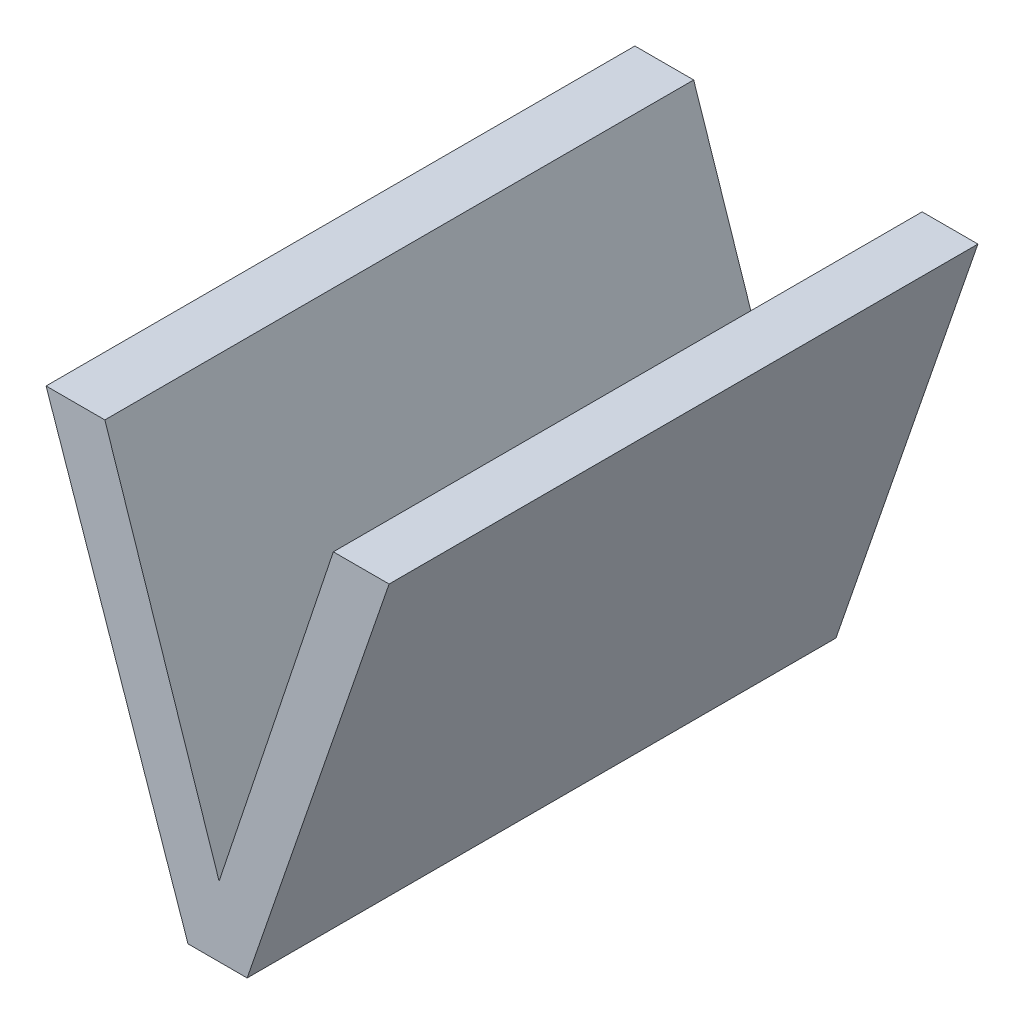
ISO-10303-21;
HEADER;
FILE_DESCRIPTION(('STEP AP214'),'2;1');
FILE_NAME('part.step','',(''),(''),'','','');
FILE_SCHEMA(('AUTOMOTIVE_DESIGN { 1 0 10303 214 1 1 1 1 }'));
ENDSEC;
DATA;
#1=APPLICATION_CONTEXT('core data for automotive mechanical design processes');
#2=APPLICATION_PROTOCOL_DEFINITION('international standard','automotive_design',2000,#1);
#3=PRODUCT_CONTEXT('',#1,'mechanical');
#4=PRODUCT('Part','Part','',(#3));
#5=PRODUCT_RELATED_PRODUCT_CATEGORY('part','',(#4));
#6=PRODUCT_DEFINITION_FORMATION('','',#4);
#7=PRODUCT_DEFINITION_CONTEXT('part definition',#1,'design');
#8=PRODUCT_DEFINITION('design','',#6,#7);
#9=PRODUCT_DEFINITION_SHAPE('','',#8);
#10=(LENGTH_UNIT() NAMED_UNIT(*) SI_UNIT(.MILLI.,.METRE.));
#11=(NAMED_UNIT(*) PLANE_ANGLE_UNIT() SI_UNIT($,.RADIAN.));
#12=(NAMED_UNIT(*) SI_UNIT($,.STERADIAN.) SOLID_ANGLE_UNIT());
#13=UNCERTAINTY_MEASURE_WITH_UNIT(LENGTH_MEASURE(1.E-05),#10,'distance_accuracy_value','');
#14=(GEOMETRIC_REPRESENTATION_CONTEXT(3) GLOBAL_UNCERTAINTY_ASSIGNED_CONTEXT((#13)) GLOBAL_UNIT_ASSIGNED_CONTEXT((#10,
#11,#12)) REPRESENTATION_CONTEXT('',''));
#15=CARTESIAN_POINT('',(0.,0.,0.));
#16=DIRECTION('',(0.,0.,1.));
#17=DIRECTION('',(1.,0.,0.));
#18=AXIS2_PLACEMENT_3D('',#15,#16,#17);
#19=CARTESIAN_POINT('',(0.958975384141096,-0.571914597659679,0.));
#20=DIRECTION('',(0.,-1.,0.));
#21=DIRECTION('',(1.,0.,0.));
#22=AXIS2_PLACEMENT_3D('',#19,#20,#21);
#23=PLANE('',#22);
#24=DIRECTION('',(-1.,0.,0.));
#25=VECTOR('',#24,1.);
#26=CARTESIAN_POINT('',(0.969015903089588,-0.571914597659679,0.));
#27=LINE('',#26,#25);
#28=CARTESIAN_POINT('',(0.969015903089588,-0.571914597659679,0.));
#29=VERTEX_POINT('',#28);
#30=CARTESIAN_POINT('',(0.958975384141096,-0.571914597659679,0.));
#31=VERTEX_POINT('',#30);
#32=EDGE_CURVE('E11',#29,#31,#27,.T.);
#33=ORIENTED_EDGE('',*,*,#32,.F.);
#34=DIRECTION('',(0.,0.,1.));
#35=VECTOR('',#34,1.);
#36=CARTESIAN_POINT('',(0.969015903089588,-0.571914597659679,0.));
#37=LINE('',#36,#35);
#38=CARTESIAN_POINT('',(0.969015903089588,-0.571914597659679,0.1));
#39=VERTEX_POINT('',#38);
#40=EDGE_CURVE('E131',#29,#39,#37,.T.);
#41=ORIENTED_EDGE('',*,*,#40,.T.);
#42=DIRECTION('',(1.,0.,0.));
#43=VECTOR('',#42,1.);
#44=CARTESIAN_POINT('',(0.958975384141096,-0.571914597659679,0.1));
#45=LINE('',#44,#43);
#46=CARTESIAN_POINT('',(0.958975384141096,-0.571914597659679,0.1));
#47=VERTEX_POINT('',#46);
#48=EDGE_CURVE('E97',#47,#39,#45,.T.);
#49=ORIENTED_EDGE('',*,*,#48,.F.);
#50=DIRECTION('',(0.,0.,1.));
#51=VECTOR('',#50,1.);
#52=CARTESIAN_POINT('',(0.958975384141096,-0.571914597659679,0.));
#53=LINE('',#52,#51);
#54=EDGE_CURVE('E126',#31,#47,#53,.T.);
#55=ORIENTED_EDGE('',*,*,#54,.F.);
#56=EDGE_LOOP('',(#33,#41,#49,#55));
#57=FACE_BOUND('',#56,.T.);
#58=ADVANCED_FACE('F17',(#57),#23,.T.);
#59=CARTESIAN_POINT('',(0.934866793445566,-0.50191459549901,0.));
#60=DIRECTION('',(-0.945495051848976,-0.325636464372622,0.));
#61=DIRECTION('',(0.325636464372622,-0.945495051848976,0.));
#62=AXIS2_PLACEMENT_3D('',#59,#60,#61);
#63=PLANE('',#62);
#64=DIRECTION('',(-0.325636464372622,0.945495051848976,0.));
#65=VECTOR('',#64,1.);
#66=CARTESIAN_POINT('',(0.958975384141096,-0.571914597659679,0.));
#67=LINE('',#66,#65);
#68=CARTESIAN_POINT('',(0.934866793445566,-0.50191459549901,0.));
#69=VERTEX_POINT('',#68);
#70=EDGE_CURVE('E24',#31,#69,#67,.T.);
#71=ORIENTED_EDGE('',*,*,#70,.F.);
#72=ORIENTED_EDGE('',*,*,#54,.T.);
#73=DIRECTION('',(0.325636464372621,-0.945495051848976,0.));
#74=VECTOR('',#73,1.);
#75=CARTESIAN_POINT('',(0.934866793445566,-0.50191459549901,0.1));
#76=LINE('',#75,#74);
#77=CARTESIAN_POINT('',(0.934866793445566,-0.50191459549901,0.1));
#78=VERTEX_POINT('',#77);
#79=EDGE_CURVE('E118',#78,#47,#76,.T.);
#80=ORIENTED_EDGE('',*,*,#79,.F.);
#81=DIRECTION('',(0.,0.,1.));
#82=VECTOR('',#81,1.);
#83=CARTESIAN_POINT('',(0.934866793445566,-0.50191459549901,0.));
#84=LINE('',#83,#82);
#85=EDGE_CURVE('E120',#69,#78,#84,.T.);
#86=ORIENTED_EDGE('',*,*,#85,.F.);
#87=EDGE_LOOP('',(#71,#72,#80,#86));
#88=FACE_BOUND('',#87,.T.);
#89=ADVANCED_FACE('F136',(#88),#63,.T.);
#90=CARTESIAN_POINT('',(0.944850586298304,-0.50191459549901,0.));
#91=DIRECTION('',(0.,1.,0.));
#92=DIRECTION('',(-1.,0.,0.));
#93=AXIS2_PLACEMENT_3D('',#90,#91,#92);
#94=PLANE('',#93);
#95=DIRECTION('',(1.,0.,0.));
#96=VECTOR('',#95,1.);
#97=CARTESIAN_POINT('',(0.934866793445566,-0.50191459549901,0.));
#98=LINE('',#97,#96);
#99=CARTESIAN_POINT('',(0.944850586298304,-0.50191459549901,0.));
#100=VERTEX_POINT('',#99);
#101=EDGE_CURVE('E128',#69,#100,#98,.T.);
#102=ORIENTED_EDGE('',*,*,#101,.F.);
#103=ORIENTED_EDGE('',*,*,#85,.T.);
#104=DIRECTION('',(-1.,0.,0.));
#105=VECTOR('',#104,1.);
#106=CARTESIAN_POINT('',(0.944850586298304,-0.50191459549901,0.1));
#107=LINE('',#106,#105);
#108=CARTESIAN_POINT('',(0.944850586298304,-0.50191459549901,0.1));
#109=VERTEX_POINT('',#108);
#110=EDGE_CURVE('E110',#109,#78,#107,.T.);
#111=ORIENTED_EDGE('',*,*,#110,.F.);
#112=DIRECTION('',(0.,0.,1.));
#113=VECTOR('',#112,1.);
#114=CARTESIAN_POINT('',(0.944850586298304,-0.50191459549901,0.));
#115=LINE('',#114,#113);
#116=EDGE_CURVE('E113',#100,#109,#115,.T.);
#117=ORIENTED_EDGE('',*,*,#116,.F.);
#118=EDGE_LOOP('',(#102,#103,#111,#117));
#119=FACE_BOUND('',#118,.T.);
#120=ADVANCED_FACE('F138',(#119),#94,.T.);
#121=CARTESIAN_POINT('',(0.964250911046236,-0.560058843647053,0.));
#122=DIRECTION('',(0.948590711989459,0.316505388780873,0.));
#123=DIRECTION('',(-0.316505388780873,0.948590711989459,0.));
#124=AXIS2_PLACEMENT_3D('',#121,#122,#123);
#125=PLANE('',#124);
#126=DIRECTION('',(0.316505388780873,-0.948590711989459,0.));
#127=VECTOR('',#126,1.);
#128=CARTESIAN_POINT('',(0.944850586298304,-0.50191459549901,0.));
#129=LINE('',#128,#127);
#130=CARTESIAN_POINT('',(0.964250911046236,-0.560058843647053,0.));
#131=VERTEX_POINT('',#130);
#132=EDGE_CURVE('E122',#100,#131,#129,.T.);
#133=ORIENTED_EDGE('',*,*,#132,.F.);
#134=ORIENTED_EDGE('',*,*,#116,.T.);
#135=DIRECTION('',(-0.316505388780875,0.948590711989458,0.));
#136=VECTOR('',#135,1.);
#137=CARTESIAN_POINT('',(0.964250911046237,-0.560058843647053,0.1));
#138=LINE('',#137,#136);
#139=CARTESIAN_POINT('',(0.964250911046236,-0.560058843647053,0.1));
#140=VERTEX_POINT('',#139);
#141=EDGE_CURVE('E103',#140,#109,#138,.T.);
#142=ORIENTED_EDGE('',*,*,#141,.F.);
#143=DIRECTION('',(0.,0.,1.));
#144=VECTOR('',#143,1.);
#145=CARTESIAN_POINT('',(0.964250911046236,-0.560058843647053,0.));
#146=LINE('',#145,#144);
#147=EDGE_CURVE('E106',#131,#140,#146,.T.);
#148=ORIENTED_EDGE('',*,*,#147,.F.);
#149=EDGE_LOOP('',(#133,#134,#142,#148));
#150=FACE_BOUND('',#149,.T.);
#151=ADVANCED_FACE('F142',(#150),#125,.T.);
#152=CARTESIAN_POINT('',(0.983651235794168,-0.50191459549901,0.));
#153=DIRECTION('',(-0.948590711989459,0.316505388780871,0.));
#154=DIRECTION('',(-0.316505388780871,-0.948590711989459,0.));
#155=AXIS2_PLACEMENT_3D('',#152,#153,#154);
#156=PLANE('',#155);
#157=DIRECTION('',(0.316505388780872,0.948590711989459,0.));
#158=VECTOR('',#157,1.);
#159=CARTESIAN_POINT('',(0.964250911046236,-0.560058843647053,0.));
#160=LINE('',#159,#158);
#161=CARTESIAN_POINT('',(0.983651235794168,-0.50191459549901,0.));
#162=VERTEX_POINT('',#161);
#163=EDGE_CURVE('E115',#131,#162,#160,.T.);
#164=ORIENTED_EDGE('',*,*,#163,.F.);
#165=ORIENTED_EDGE('',*,*,#147,.T.);
#166=DIRECTION('',(-0.316505388780875,-0.948590711989458,0.));
#167=VECTOR('',#166,1.);
#168=CARTESIAN_POINT('',(0.983651235794169,-0.50191459549901,0.1));
#169=LINE('',#168,#167);
#170=CARTESIAN_POINT('',(0.983651235794168,-0.50191459549901,0.1));
#171=VERTEX_POINT('',#170);
#172=EDGE_CURVE('E83',#171,#140,#169,.T.);
#173=ORIENTED_EDGE('',*,*,#172,.F.);
#174=DIRECTION('',(0.,0.,1.));
#175=VECTOR('',#174,1.);
#176=CARTESIAN_POINT('',(0.983651235794168,-0.50191459549901,0.));
#177=LINE('',#176,#175);
#178=EDGE_CURVE('E89',#162,#171,#177,.T.);
#179=ORIENTED_EDGE('',*,*,#178,.F.);
#180=EDGE_LOOP('',(#164,#165,#173,#179));
#181=FACE_BOUND('',#180,.T.);
#182=ADVANCED_FACE('F145',(#181),#156,.T.);
#183=CARTESIAN_POINT('',(0.993124493785118,-0.50191459549901,0.));
#184=DIRECTION('',(0.,1.,0.));
#185=DIRECTION('',(-1.,0.,0.));
#186=AXIS2_PLACEMENT_3D('',#183,#184,#185);
#187=PLANE('',#186);
#188=DIRECTION('',(1.,0.,0.));
#189=VECTOR('',#188,1.);
#190=CARTESIAN_POINT('',(0.983651235794168,-0.50191459549901,0.));
#191=LINE('',#190,#189);
#192=CARTESIAN_POINT('',(0.993124493785118,-0.50191459549901,0.));
#193=VERTEX_POINT('',#192);
#194=EDGE_CURVE('E108',#162,#193,#191,.T.);
#195=ORIENTED_EDGE('',*,*,#194,.F.);
#196=ORIENTED_EDGE('',*,*,#178,.T.);
#197=DIRECTION('',(-1.,0.,0.));
#198=VECTOR('',#197,1.);
#199=CARTESIAN_POINT('',(0.993124493785118,-0.50191459549901,0.1));
#200=LINE('',#199,#198);
#201=CARTESIAN_POINT('',(0.993124493785118,-0.50191459549901,0.1));
#202=VERTEX_POINT('',#201);
#203=EDGE_CURVE('E84',#202,#171,#200,.T.);
#204=ORIENTED_EDGE('',*,*,#203,.F.);
#205=DIRECTION('',(0.,0.,1.));
#206=VECTOR('',#205,1.);
#207=CARTESIAN_POINT('',(0.993124493785118,-0.50191459549901,0.));
#208=LINE('',#207,#206);
#209=EDGE_CURVE('E73',#193,#202,#208,.T.);
#210=ORIENTED_EDGE('',*,*,#209,.F.);
#211=EDGE_LOOP('',(#195,#196,#204,#210));
#212=FACE_BOUND('',#211,.T.);
#213=ADVANCED_FACE('F87',(#212),#187,.T.);
#214=CARTESIAN_POINT('',(0.969015903089588,-0.571914597659679,0.));
#215=DIRECTION('',(0.945495051848976,-0.325636464372622,0.));
#216=DIRECTION('',(0.325636464372622,0.945495051848976,0.));
#217=AXIS2_PLACEMENT_3D('',#214,#215,#216);
#218=PLANE('',#217);
#219=DIRECTION('',(-0.325636464372621,-0.945495051848977,0.));
#220=VECTOR('',#219,1.);
#221=CARTESIAN_POINT('',(0.993124493785118,-0.50191459549901,0.));
#222=LINE('',#221,#220);
#223=EDGE_CURVE('E80',#193,#29,#222,.T.);
#224=ORIENTED_EDGE('',*,*,#223,.F.);
#225=ORIENTED_EDGE('',*,*,#209,.T.);
#226=DIRECTION('',(0.325636464372622,0.945495051848976,0.));
#227=VECTOR('',#226,1.);
#228=CARTESIAN_POINT('',(0.969015903089588,-0.571914597659679,0.1));
#229=LINE('',#228,#227);
#230=EDGE_CURVE('E78',#39,#202,#229,.T.);
#231=ORIENTED_EDGE('',*,*,#230,.F.);
#232=ORIENTED_EDGE('',*,*,#40,.F.);
#233=EDGE_LOOP('',(#224,#225,#231,#232));
#234=FACE_BOUND('',#233,.T.);
#235=ADVANCED_FACE('F75',(#234),#218,.T.);
#236=CARTESIAN_POINT('',(0.964066902182152,-0.533395521757491,0.));
#237=DIRECTION('',(0.,0.,1.));
#238=DIRECTION('',(1.,0.,0.));
#239=AXIS2_PLACEMENT_3D('',#236,#237,#238);
#240=PLANE('',#239);
#241=ORIENTED_EDGE('',*,*,#223,.T.);
#242=ORIENTED_EDGE('',*,*,#32,.T.);
#243=ORIENTED_EDGE('',*,*,#70,.T.);
#244=ORIENTED_EDGE('',*,*,#101,.T.);
#245=ORIENTED_EDGE('',*,*,#132,.T.);
#246=ORIENTED_EDGE('',*,*,#163,.T.);
#247=ORIENTED_EDGE('',*,*,#194,.T.);
#248=EDGE_LOOP('',(#241,#242,#243,#244,#245,#246,#247));
#249=FACE_BOUND('',#248,.T.);
#250=ADVANCED_FACE('F133',(#249),#240,.F.);
#251=CARTESIAN_POINT('',(0.964066902182152,-0.533395521757491,0.1));
#252=DIRECTION('',(0.,0.,1.));
#253=DIRECTION('',(1.,0.,0.));
#254=AXIS2_PLACEMENT_3D('',#251,#252,#253);
#255=PLANE('',#254);
#256=ORIENTED_EDGE('',*,*,#230,.T.);
#257=ORIENTED_EDGE('',*,*,#203,.T.);
#258=ORIENTED_EDGE('',*,*,#172,.T.);
#259=ORIENTED_EDGE('',*,*,#141,.T.);
#260=ORIENTED_EDGE('',*,*,#110,.T.);
#261=ORIENTED_EDGE('',*,*,#79,.T.);
#262=ORIENTED_EDGE('',*,*,#48,.T.);
#263=EDGE_LOOP('',(#256,#257,#258,#259,#260,#261,#262));
#264=FACE_BOUND('',#263,.T.);
#265=ADVANCED_FACE('F94',(#264),#255,.T.);
#266=CLOSED_SHELL('',(#58,#89,#120,#151,#182,#213,#235,#250,#265));
#267=MANIFOLD_SOLID_BREP('B1',#266);
#268=ADVANCED_BREP_SHAPE_REPRESENTATION('',(#18,#267),#14);
#269=SHAPE_DEFINITION_REPRESENTATION(#9,#268);
ENDSEC;
END-ISO-10303-21;
